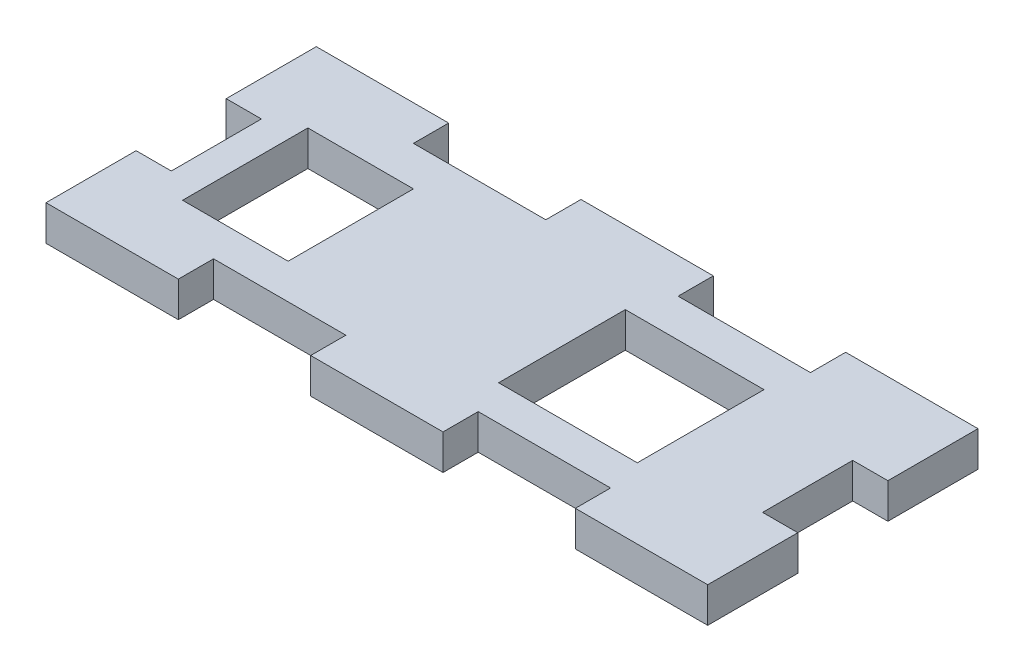
ISO-10303-21;
HEADER;
FILE_DESCRIPTION(('STEP AP214'),'2;1');
FILE_NAME('part.step','',(''),(''),'','','');
FILE_SCHEMA(('AUTOMOTIVE_DESIGN { 1 0 10303 214 1 1 1 1 }'));
ENDSEC;
DATA;
#1=APPLICATION_CONTEXT('core data for automotive mechanical design processes');
#2=APPLICATION_PROTOCOL_DEFINITION('international standard','automotive_design',2000,#1);
#3=PRODUCT_CONTEXT('',#1,'mechanical');
#4=PRODUCT('Part','Part','',(#3));
#5=PRODUCT_RELATED_PRODUCT_CATEGORY('part','',(#4));
#6=PRODUCT_DEFINITION_FORMATION('','',#4);
#7=PRODUCT_DEFINITION_CONTEXT('part definition',#1,'design');
#8=PRODUCT_DEFINITION('design','',#6,#7);
#9=PRODUCT_DEFINITION_SHAPE('','',#8);
#10=(LENGTH_UNIT() NAMED_UNIT(*) SI_UNIT(.MILLI.,.METRE.));
#11=(NAMED_UNIT(*) PLANE_ANGLE_UNIT() SI_UNIT($,.RADIAN.));
#12=(NAMED_UNIT(*) SI_UNIT($,.STERADIAN.) SOLID_ANGLE_UNIT());
#13=UNCERTAINTY_MEASURE_WITH_UNIT(LENGTH_MEASURE(1.E-05),#10,'distance_accuracy_value','');
#14=(GEOMETRIC_REPRESENTATION_CONTEXT(3) GLOBAL_UNCERTAINTY_ASSIGNED_CONTEXT((#13)) GLOBAL_UNIT_ASSIGNED_CONTEXT((#10,
#11,#12)) REPRESENTATION_CONTEXT('',''));
#15=CARTESIAN_POINT('',(0.,0.,0.));
#16=DIRECTION('',(0.,0.,1.));
#17=DIRECTION('',(1.,0.,0.));
#18=AXIS2_PLACEMENT_3D('',#15,#16,#17);
#19=CARTESIAN_POINT('',(29.845,3.175,12.192));
#20=DIRECTION('',(-1.,0.,0.));
#21=DIRECTION('',(0.,0.,1.));
#22=AXIS2_PLACEMENT_3D('',#19,#20,#21);
#23=PLANE('',#22);
#24=DIRECTION('',(0.,0.,-1.));
#25=VECTOR('',#24,1.);
#26=CARTESIAN_POINT('',(29.845,0.,12.192));
#27=LINE('',#26,#25);
#28=CARTESIAN_POINT('',(29.845,0.,12.192));
#29=VERTEX_POINT('',#28);
#30=CARTESIAN_POINT('',(29.845,0.,4.064));
#31=VERTEX_POINT('',#30);
#32=EDGE_CURVE('E506',#29,#31,#27,.T.);
#33=ORIENTED_EDGE('',*,*,#32,.T.);
#34=DIRECTION('',(0.,1.,0.));
#35=VECTOR('',#34,1.);
#36=CARTESIAN_POINT('',(29.845,3.175,4.064));
#37=LINE('',#36,#35);
#38=CARTESIAN_POINT('',(29.845,3.175,4.064));
#39=VERTEX_POINT('',#38);
#40=EDGE_CURVE('E372',#31,#39,#37,.T.);
#41=ORIENTED_EDGE('',*,*,#40,.T.);
#42=DIRECTION('',(0.,0.,-1.));
#43=VECTOR('',#42,1.);
#44=CARTESIAN_POINT('',(29.845,3.175,12.192));
#45=LINE('',#44,#43);
#46=CARTESIAN_POINT('',(29.845,3.175,12.192));
#47=VERTEX_POINT('',#46);
#48=EDGE_CURVE('E487',#47,#39,#45,.T.);
#49=ORIENTED_EDGE('',*,*,#48,.F.);
#50=DIRECTION('',(0.,-1.,0.));
#51=VECTOR('',#50,1.);
#52=CARTESIAN_POINT('',(29.845,3.175,12.192));
#53=LINE('',#52,#51);
#54=EDGE_CURVE('E504',#47,#29,#53,.T.);
#55=ORIENTED_EDGE('',*,*,#54,.T.);
#56=EDGE_LOOP('',(#33,#41,#49,#55));
#57=FACE_BOUND('',#56,.T.);
#58=ADVANCED_FACE('F32',(#57),#23,.F.);
#59=CARTESIAN_POINT('',(-29.845,3.175,12.192));
#60=DIRECTION('',(1.,0.,0.));
#61=DIRECTION('',(0.,0.,-1.));
#62=AXIS2_PLACEMENT_3D('',#59,#60,#61);
#63=PLANE('',#62);
#64=DIRECTION('',(0.,0.,1.));
#65=VECTOR('',#64,1.);
#66=CARTESIAN_POINT('',(-29.845,3.175,12.192));
#67=LINE('',#66,#65);
#68=CARTESIAN_POINT('',(-29.845,3.175,4.064));
#69=VERTEX_POINT('',#68);
#70=CARTESIAN_POINT('',(-29.845,3.175,12.192));
#71=VERTEX_POINT('',#70);
#72=EDGE_CURVE('E495',#69,#71,#67,.T.);
#73=ORIENTED_EDGE('',*,*,#72,.F.);
#74=DIRECTION('',(0.,-1.,0.));
#75=VECTOR('',#74,1.);
#76=CARTESIAN_POINT('',(-29.845,3.175,4.064));
#77=LINE('',#76,#75);
#78=CARTESIAN_POINT('',(-29.845,0.,4.064));
#79=VERTEX_POINT('',#78);
#80=EDGE_CURVE('E378',#69,#79,#77,.T.);
#81=ORIENTED_EDGE('',*,*,#80,.T.);
#82=DIRECTION('',(0.,0.,1.));
#83=VECTOR('',#82,1.);
#84=CARTESIAN_POINT('',(-29.845,0.,12.192));
#85=LINE('',#84,#83);
#86=CARTESIAN_POINT('',(-29.845,0.,12.192));
#87=VERTEX_POINT('',#86);
#88=EDGE_CURVE('E513',#79,#87,#85,.T.);
#89=ORIENTED_EDGE('',*,*,#88,.T.);
#90=DIRECTION('',(0.,-1.,0.));
#91=VECTOR('',#90,1.);
#92=CARTESIAN_POINT('',(-29.845,3.175,12.192));
#93=LINE('',#92,#91);
#94=EDGE_CURVE('E525',#71,#87,#93,.T.);
#95=ORIENTED_EDGE('',*,*,#94,.F.);
#96=EDGE_LOOP('',(#73,#81,#89,#95));
#97=FACE_BOUND('',#96,.T.);
#98=ADVANCED_FACE('F602',(#97),#63,.F.);
#99=CARTESIAN_POINT('',(-29.845,3.175,-12.192));
#100=DIRECTION('',(0.,0.,1.));
#101=DIRECTION('',(1.,0.,0.));
#102=AXIS2_PLACEMENT_3D('',#99,#100,#101);
#103=PLANE('',#102);
#104=DIRECTION('',(-1.,0.,0.));
#105=VECTOR('',#104,1.);
#106=CARTESIAN_POINT('',(-29.845,3.175,-12.192));
#107=LINE('',#106,#105);
#108=CARTESIAN_POINT('',(-17.907,3.175,-12.192));
#109=VERTEX_POINT('',#108);
#110=CARTESIAN_POINT('',(-29.845,3.175,-12.192));
#111=VERTEX_POINT('',#110);
#112=EDGE_CURVE('E490',#109,#111,#107,.T.);
#113=ORIENTED_EDGE('',*,*,#112,.F.);
#114=DIRECTION('',(0.,1.,0.));
#115=VECTOR('',#114,1.);
#116=CARTESIAN_POINT('',(-17.907,0.,-12.192));
#117=LINE('',#116,#115);
#118=CARTESIAN_POINT('',(-17.907,0.,-12.192));
#119=VERTEX_POINT('',#118);
#120=EDGE_CURVE('E401',#119,#109,#117,.T.);
#121=ORIENTED_EDGE('',*,*,#120,.F.);
#122=DIRECTION('',(-1.,0.,0.));
#123=VECTOR('',#122,1.);
#124=CARTESIAN_POINT('',(-29.845,0.,-12.192));
#125=LINE('',#124,#123);
#126=CARTESIAN_POINT('',(-29.845,0.,-12.192));
#127=VERTEX_POINT('',#126);
#128=EDGE_CURVE('E509',#119,#127,#125,.T.);
#129=ORIENTED_EDGE('',*,*,#128,.T.);
#130=DIRECTION('',(0.,-1.,0.));
#131=VECTOR('',#130,1.);
#132=CARTESIAN_POINT('',(-29.845,3.175,-12.192));
#133=LINE('',#132,#131);
#134=EDGE_CURVE('E528',#111,#127,#133,.T.);
#135=ORIENTED_EDGE('',*,*,#134,.F.);
#136=EDGE_LOOP('',(#113,#121,#129,#135));
#137=FACE_BOUND('',#136,.T.);
#138=ADVANCED_FACE('F606',(#137),#103,.F.);
#139=CARTESIAN_POINT('',(-29.845,3.175,12.192));
#140=DIRECTION('',(0.,0.,-1.));
#141=DIRECTION('',(-1.,0.,0.));
#142=AXIS2_PLACEMENT_3D('',#139,#140,#141);
#143=PLANE('',#142);
#144=DIRECTION('',(1.,0.,0.));
#145=VECTOR('',#144,1.);
#146=CARTESIAN_POINT('',(-29.845,0.,12.192));
#147=LINE('',#146,#145);
#148=CARTESIAN_POINT('',(-17.907,0.,12.192));
#149=VERTEX_POINT('',#148);
#150=EDGE_CURVE('E519',#87,#149,#147,.T.);
#151=ORIENTED_EDGE('',*,*,#150,.T.);
#152=DIRECTION('',(0.,1.,0.));
#153=VECTOR('',#152,1.);
#154=CARTESIAN_POINT('',(-17.907,0.,12.192));
#155=LINE('',#154,#153);
#156=CARTESIAN_POINT('',(-17.907,3.175,12.192));
#157=VERTEX_POINT('',#156);
#158=EDGE_CURVE('E420',#149,#157,#155,.T.);
#159=ORIENTED_EDGE('',*,*,#158,.T.);
#160=DIRECTION('',(1.,0.,0.));
#161=VECTOR('',#160,1.);
#162=CARTESIAN_POINT('',(-29.845,3.175,12.192));
#163=LINE('',#162,#161);
#164=EDGE_CURVE('E501',#71,#157,#163,.T.);
#165=ORIENTED_EDGE('',*,*,#164,.F.);
#166=ORIENTED_EDGE('',*,*,#94,.T.);
#167=EDGE_LOOP('',(#151,#159,#165,#166));
#168=FACE_BOUND('',#167,.T.);
#169=ADVANCED_FACE('F617',(#168),#143,.F.);
#170=CARTESIAN_POINT('',(5.969,0.,-12.192));
#171=VERTEX_POINT('',#170);
#172=CARTESIAN_POINT('',(-5.969,0.,-12.192));
#173=VERTEX_POINT('',#172);
#174=EDGE_CURVE('E514',#171,#173,#125,.T.);
#175=ORIENTED_EDGE('',*,*,#174,.T.);
#176=DIRECTION('',(0.,1.,0.));
#177=VECTOR('',#176,1.);
#178=CARTESIAN_POINT('',(-5.969,0.,-12.192));
#179=LINE('',#178,#177);
#180=CARTESIAN_POINT('',(-5.969,3.175,-12.192));
#181=VERTEX_POINT('',#180);
#182=EDGE_CURVE('E404',#173,#181,#179,.T.);
#183=ORIENTED_EDGE('',*,*,#182,.T.);
#184=CARTESIAN_POINT('',(5.969,3.175,-12.192));
#185=VERTEX_POINT('',#184);
#186=EDGE_CURVE('E496',#185,#181,#107,.T.);
#187=ORIENTED_EDGE('',*,*,#186,.F.);
#188=DIRECTION('',(0.,1.,0.));
#189=VECTOR('',#188,1.);
#190=CARTESIAN_POINT('',(5.969,0.,-12.192));
#191=LINE('',#190,#189);
#192=EDGE_CURVE('E453',#171,#185,#191,.T.);
#193=ORIENTED_EDGE('',*,*,#192,.F.);
#194=EDGE_LOOP('',(#175,#183,#187,#193));
#195=FACE_BOUND('',#194,.T.);
#196=ADVANCED_FACE('F615',(#195),#103,.F.);
#197=CARTESIAN_POINT('',(-5.969,3.175,12.192));
#198=VERTEX_POINT('',#197);
#199=CARTESIAN_POINT('',(5.96899999999999,3.175,12.192));
#200=VERTEX_POINT('',#199);
#201=EDGE_CURVE('E505',#198,#200,#163,.T.);
#202=ORIENTED_EDGE('',*,*,#201,.F.);
#203=DIRECTION('',(0.,1.,0.));
#204=VECTOR('',#203,1.);
#205=CARTESIAN_POINT('',(-5.969,0.,12.192));
#206=LINE('',#205,#204);
#207=CARTESIAN_POINT('',(-5.969,0.,12.192));
#208=VERTEX_POINT('',#207);
#209=EDGE_CURVE('E430',#208,#198,#206,.T.);
#210=ORIENTED_EDGE('',*,*,#209,.F.);
#211=CARTESIAN_POINT('',(5.96899999999999,0.,12.192));
#212=VERTEX_POINT('',#211);
#213=EDGE_CURVE('E522',#208,#212,#147,.T.);
#214=ORIENTED_EDGE('',*,*,#213,.T.);
#215=DIRECTION('',(0.,1.,0.));
#216=VECTOR('',#215,1.);
#217=CARTESIAN_POINT('',(5.96899999999999,0.,12.192));
#218=LINE('',#217,#216);
#219=EDGE_CURVE('E472',#212,#200,#218,.T.);
#220=ORIENTED_EDGE('',*,*,#219,.T.);
#221=EDGE_LOOP('',(#202,#210,#214,#220));
#222=FACE_BOUND('',#221,.T.);
#223=ADVANCED_FACE('F573',(#222),#143,.F.);
#224=CARTESIAN_POINT('',(29.845,3.175,-4.064));
#225=VERTEX_POINT('',#224);
#226=CARTESIAN_POINT('',(29.845,3.175,-12.192));
#227=VERTEX_POINT('',#226);
#228=EDGE_CURVE('E491',#225,#227,#45,.T.);
#229=ORIENTED_EDGE('',*,*,#228,.F.);
#230=DIRECTION('',(0.,-1.,0.));
#231=VECTOR('',#230,1.);
#232=CARTESIAN_POINT('',(29.845,3.175,-4.064));
#233=LINE('',#232,#231);
#234=CARTESIAN_POINT('',(29.845,0.,-4.064));
#235=VERTEX_POINT('',#234);
#236=EDGE_CURVE('E352',#225,#235,#233,.T.);
#237=ORIENTED_EDGE('',*,*,#236,.T.);
#238=CARTESIAN_POINT('',(29.845,0.,-12.192));
#239=VERTEX_POINT('',#238);
#240=EDGE_CURVE('E455',#235,#239,#27,.T.);
#241=ORIENTED_EDGE('',*,*,#240,.T.);
#242=DIRECTION('',(0.,-1.,0.));
#243=VECTOR('',#242,1.);
#244=CARTESIAN_POINT('',(29.845,3.175,-12.192));
#245=LINE('',#244,#243);
#246=EDGE_CURVE('E531',#227,#239,#245,.T.);
#247=ORIENTED_EDGE('',*,*,#246,.F.);
#248=EDGE_LOOP('',(#229,#237,#241,#247));
#249=FACE_BOUND('',#248,.T.);
#250=ADVANCED_FACE('F34',(#249),#23,.F.);
#251=CARTESIAN_POINT('',(17.907,0.,-12.192));
#252=VERTEX_POINT('',#251);
#253=EDGE_CURVE('E510',#239,#252,#125,.T.);
#254=ORIENTED_EDGE('',*,*,#253,.T.);
#255=DIRECTION('',(0.,1.,0.));
#256=VECTOR('',#255,1.);
#257=CARTESIAN_POINT('',(17.907,0.,-12.192));
#258=LINE('',#257,#256);
#259=CARTESIAN_POINT('',(17.907,3.175,-12.192));
#260=VERTEX_POINT('',#259);
#261=EDGE_CURVE('E456',#252,#260,#258,.T.);
#262=ORIENTED_EDGE('',*,*,#261,.T.);
#263=EDGE_CURVE('E492',#227,#260,#107,.T.);
#264=ORIENTED_EDGE('',*,*,#263,.F.);
#265=ORIENTED_EDGE('',*,*,#246,.T.);
#266=EDGE_LOOP('',(#254,#262,#264,#265));
#267=FACE_BOUND('',#266,.T.);
#268=ADVANCED_FACE('F547',(#267),#103,.F.);
#269=CARTESIAN_POINT('',(-29.845,0.,-4.06399999999999));
#270=VERTEX_POINT('',#269);
#271=EDGE_CURVE('E515',#127,#270,#85,.T.);
#272=ORIENTED_EDGE('',*,*,#271,.T.);
#273=DIRECTION('',(0.,1.,0.));
#274=VECTOR('',#273,1.);
#275=CARTESIAN_POINT('',(-29.845,3.175,-4.064));
#276=LINE('',#275,#274);
#277=CARTESIAN_POINT('',(-29.845,3.175,-4.064));
#278=VERTEX_POINT('',#277);
#279=EDGE_CURVE('E375',#270,#278,#276,.T.);
#280=ORIENTED_EDGE('',*,*,#279,.T.);
#281=EDGE_CURVE('E497',#111,#278,#67,.T.);
#282=ORIENTED_EDGE('',*,*,#281,.F.);
#283=ORIENTED_EDGE('',*,*,#134,.T.);
#284=EDGE_LOOP('',(#272,#280,#282,#283));
#285=FACE_BOUND('',#284,.T.);
#286=ADVANCED_FACE('F609',(#285),#63,.F.);
#287=CARTESIAN_POINT('',(17.907,3.175,12.192));
#288=VERTEX_POINT('',#287);
#289=EDGE_CURVE('E500',#288,#47,#163,.T.);
#290=ORIENTED_EDGE('',*,*,#289,.F.);
#291=DIRECTION('',(0.,1.,0.));
#292=VECTOR('',#291,1.);
#293=CARTESIAN_POINT('',(17.907,0.,12.192));
#294=LINE('',#293,#292);
#295=CARTESIAN_POINT('',(17.907,0.,12.192));
#296=VERTEX_POINT('',#295);
#297=EDGE_CURVE('E483',#296,#288,#294,.T.);
#298=ORIENTED_EDGE('',*,*,#297,.F.);
#299=EDGE_CURVE('E518',#296,#29,#147,.T.);
#300=ORIENTED_EDGE('',*,*,#299,.T.);
#301=ORIENTED_EDGE('',*,*,#54,.F.);
#302=EDGE_LOOP('',(#290,#298,#300,#301));
#303=FACE_BOUND('',#302,.T.);
#304=ADVANCED_FACE('F566',(#303),#143,.F.);
#305=CARTESIAN_POINT('',(0.,3.175,0.));
#306=DIRECTION('',(0.,-1.,0.));
#307=DIRECTION('',(0.,0.,-1.));
#308=AXIS2_PLACEMENT_3D('',#305,#306,#307);
#309=PLANE('',#308);
#310=DIRECTION('',(1.,0.,0.));
#311=VECTOR('',#310,1.);
#312=CARTESIAN_POINT('',(-23.876,3.175,5.842));
#313=LINE('',#312,#311);
#314=CARTESIAN_POINT('',(-23.876,3.175,5.842));
#315=VERTEX_POINT('',#314);
#316=CARTESIAN_POINT('',(-14.351,3.175,5.842));
#317=VERTEX_POINT('',#316);
#318=EDGE_CURVE('E294',#315,#317,#313,.T.);
#319=ORIENTED_EDGE('',*,*,#318,.F.);
#320=DIRECTION('',(0.,0.,1.));
#321=VECTOR('',#320,1.);
#322=CARTESIAN_POINT('',(-23.876,3.175,5.842));
#323=LINE('',#322,#321);
#324=CARTESIAN_POINT('',(-23.876,3.175,-5.461));
#325=VERTEX_POINT('',#324);
#326=EDGE_CURVE('E47',#325,#315,#323,.T.);
#327=ORIENTED_EDGE('',*,*,#326,.F.);
#328=DIRECTION('',(-1.,0.,0.));
#329=VECTOR('',#328,1.);
#330=CARTESIAN_POINT('',(-23.876,3.175,-5.461));
#331=LINE('',#330,#329);
#332=CARTESIAN_POINT('',(-14.351,3.175,-5.461));
#333=VERTEX_POINT('',#332);
#334=EDGE_CURVE('E285',#333,#325,#331,.T.);
#335=ORIENTED_EDGE('',*,*,#334,.F.);
#336=DIRECTION('',(0.,0.,-1.));
#337=VECTOR('',#336,1.);
#338=CARTESIAN_POINT('',(-14.351,3.175,5.842));
#339=LINE('',#338,#337);
#340=EDGE_CURVE('E288',#317,#333,#339,.T.);
#341=ORIENTED_EDGE('',*,*,#340,.F.);
#342=EDGE_LOOP('',(#319,#327,#335,#341));
#343=FACE_BOUND('',#342,.T.);
#344=DIRECTION('',(1.,0.,0.));
#345=VECTOR('',#344,1.);
#346=CARTESIAN_POINT('',(17.145,3.175,5.842));
#347=LINE('',#346,#345);
#348=CARTESIAN_POINT('',(4.6355,3.175,5.842));
#349=VERTEX_POINT('',#348);
#350=CARTESIAN_POINT('',(17.145,3.175,5.842));
#351=VERTEX_POINT('',#350);
#352=EDGE_CURVE('E320',#349,#351,#347,.T.);
#353=ORIENTED_EDGE('',*,*,#352,.F.);
#354=DIRECTION('',(0.,0.,1.));
#355=VECTOR('',#354,1.);
#356=CARTESIAN_POINT('',(4.6355,3.175,5.842));
#357=LINE('',#356,#355);
#358=CARTESIAN_POINT('',(4.6355,3.175,-5.588));
#359=VERTEX_POINT('',#358);
#360=EDGE_CURVE('E55',#359,#349,#357,.T.);
#361=ORIENTED_EDGE('',*,*,#360,.F.);
#362=DIRECTION('',(-1.,0.,0.));
#363=VECTOR('',#362,1.);
#364=CARTESIAN_POINT('',(17.145,3.175,-5.588));
#365=LINE('',#364,#363);
#366=CARTESIAN_POINT('',(17.145,3.175,-5.588));
#367=VERTEX_POINT('',#366);
#368=EDGE_CURVE('E309',#367,#359,#365,.T.);
#369=ORIENTED_EDGE('',*,*,#368,.F.);
#370=DIRECTION('',(0.,0.,-1.));
#371=VECTOR('',#370,1.);
#372=CARTESIAN_POINT('',(17.145,3.175,5.842));
#373=LINE('',#372,#371);
#374=EDGE_CURVE('E323',#351,#367,#373,.T.);
#375=ORIENTED_EDGE('',*,*,#374,.F.);
#376=EDGE_LOOP('',(#353,#361,#369,#375));
#377=FACE_BOUND('',#376,.T.);
#378=DIRECTION('',(0.,0.,-1.));
#379=VECTOR('',#378,1.);
#380=CARTESIAN_POINT('',(-26.67,3.175,4.064));
#381=LINE('',#380,#379);
#382=CARTESIAN_POINT('',(-26.67,3.175,4.064));
#383=VERTEX_POINT('',#382);
#384=CARTESIAN_POINT('',(-26.67,3.175,-4.064));
#385=VERTEX_POINT('',#384);
#386=EDGE_CURVE('E342',#383,#385,#381,.T.);
#387=ORIENTED_EDGE('',*,*,#386,.F.);
#388=DIRECTION('',(1.,0.,0.));
#389=VECTOR('',#388,1.);
#390=CARTESIAN_POINT('',(-33.02,3.175,4.064));
#391=LINE('',#390,#389);
#392=EDGE_CURVE('E338',#69,#383,#391,.T.);
#393=ORIENTED_EDGE('',*,*,#392,.F.);
#394=ORIENTED_EDGE('',*,*,#72,.T.);
#395=ORIENTED_EDGE('',*,*,#164,.T.);
#396=DIRECTION('',(0.,0.,1.));
#397=VECTOR('',#396,1.);
#398=CARTESIAN_POINT('',(-17.907,3.175,12.192));
#399=LINE('',#398,#397);
#400=CARTESIAN_POINT('',(-17.907,3.175,9.017));
#401=VERTEX_POINT('',#400);
#402=EDGE_CURVE('E381',#401,#157,#399,.T.);
#403=ORIENTED_EDGE('',*,*,#402,.F.);
#404=DIRECTION('',(-1.,0.,0.));
#405=VECTOR('',#404,1.);
#406=CARTESIAN_POINT('',(-17.907,3.175,9.017));
#407=LINE('',#406,#405);
#408=CARTESIAN_POINT('',(-5.969,3.175,9.017));
#409=VERTEX_POINT('',#408);
#410=EDGE_CURVE('E414',#409,#401,#407,.T.);
#411=ORIENTED_EDGE('',*,*,#410,.F.);
#412=DIRECTION('',(0.,0.,-1.));
#413=VECTOR('',#412,1.);
#414=CARTESIAN_POINT('',(-5.969,3.175,12.192));
#415=LINE('',#414,#413);
#416=EDGE_CURVE('E422',#198,#409,#415,.T.);
#417=ORIENTED_EDGE('',*,*,#416,.F.);
#418=ORIENTED_EDGE('',*,*,#201,.T.);
#419=DIRECTION('',(0.,0.,1.));
#420=VECTOR('',#419,1.);
#421=CARTESIAN_POINT('',(5.96899999999999,3.175,12.192));
#422=LINE('',#421,#420);
#423=CARTESIAN_POINT('',(5.96899999999999,3.175,9.017));
#424=VERTEX_POINT('',#423);
#425=EDGE_CURVE('E403',#424,#200,#422,.T.);
#426=ORIENTED_EDGE('',*,*,#425,.F.);
#427=DIRECTION('',(-1.,0.,0.));
#428=VECTOR('',#427,1.);
#429=CARTESIAN_POINT('',(5.96899999999999,3.175,9.017));
#430=LINE('',#429,#428);
#431=CARTESIAN_POINT('',(17.907,3.175,9.017));
#432=VERTEX_POINT('',#431);
#433=EDGE_CURVE('E466',#432,#424,#430,.T.);
#434=ORIENTED_EDGE('',*,*,#433,.F.);
#435=DIRECTION('',(0.,0.,-1.));
#436=VECTOR('',#435,1.);
#437=CARTESIAN_POINT('',(17.907,3.175,12.192));
#438=LINE('',#437,#436);
#439=EDGE_CURVE('E475',#288,#432,#438,.T.);
#440=ORIENTED_EDGE('',*,*,#439,.F.);
#441=ORIENTED_EDGE('',*,*,#289,.T.);
#442=ORIENTED_EDGE('',*,*,#48,.T.);
#443=DIRECTION('',(1.,0.,0.));
#444=VECTOR('',#443,1.);
#445=CARTESIAN_POINT('',(26.67,3.175,4.064));
#446=LINE('',#445,#444);
#447=CARTESIAN_POINT('',(26.67,3.175,4.064));
#448=VERTEX_POINT('',#447);
#449=EDGE_CURVE('E358',#448,#39,#446,.T.);
#450=ORIENTED_EDGE('',*,*,#449,.F.);
#451=DIRECTION('',(0.,0.,1.));
#452=VECTOR('',#451,1.);
#453=CARTESIAN_POINT('',(26.67,3.175,4.064));
#454=LINE('',#453,#452);
#455=CARTESIAN_POINT('',(26.67,3.175,-4.064));
#456=VERTEX_POINT('',#455);
#457=EDGE_CURVE('E363',#456,#448,#454,.T.);
#458=ORIENTED_EDGE('',*,*,#457,.F.);
#459=DIRECTION('',(-1.,0.,0.));
#460=VECTOR('',#459,1.);
#461=CARTESIAN_POINT('',(26.67,3.175,-4.064));
#462=LINE('',#461,#460);
#463=EDGE_CURVE('E301',#225,#456,#462,.T.);
#464=ORIENTED_EDGE('',*,*,#463,.F.);
#465=ORIENTED_EDGE('',*,*,#228,.T.);
#466=ORIENTED_EDGE('',*,*,#263,.T.);
#467=DIRECTION('',(0.,0.,-1.));
#468=VECTOR('',#467,1.);
#469=CARTESIAN_POINT('',(17.907,3.175,-9.01700000000001));
#470=LINE('',#469,#468);
#471=CARTESIAN_POINT('',(17.907,3.175,-9.01700000000001));
#472=VERTEX_POINT('',#471);
#473=EDGE_CURVE('E438',#472,#260,#470,.T.);
#474=ORIENTED_EDGE('',*,*,#473,.F.);
#475=DIRECTION('',(1.,0.,0.));
#476=VECTOR('',#475,1.);
#477=CARTESIAN_POINT('',(5.969,3.175,-9.01700000000001));
#478=LINE('',#477,#476);
#479=CARTESIAN_POINT('',(5.969,3.175,-9.01700000000001));
#480=VERTEX_POINT('',#479);
#481=EDGE_CURVE('E448',#480,#472,#478,.T.);
#482=ORIENTED_EDGE('',*,*,#481,.F.);
#483=DIRECTION('',(0.,0.,1.));
#484=VECTOR('',#483,1.);
#485=CARTESIAN_POINT('',(5.969,3.175,-9.01700000000001));
#486=LINE('',#485,#484);
#487=EDGE_CURVE('E445',#185,#480,#486,.T.);
#488=ORIENTED_EDGE('',*,*,#487,.F.);
#489=ORIENTED_EDGE('',*,*,#186,.T.);
#490=DIRECTION('',(0.,0.,-1.));
#491=VECTOR('',#490,1.);
#492=CARTESIAN_POINT('',(-5.969,3.175,-9.01700000000001));
#493=LINE('',#492,#491);
#494=CARTESIAN_POINT('',(-5.969,3.175,-9.01700000000001));
#495=VERTEX_POINT('',#494);
#496=EDGE_CURVE('E386',#495,#181,#493,.T.);
#497=ORIENTED_EDGE('',*,*,#496,.F.);
#498=DIRECTION('',(1.,0.,0.));
#499=VECTOR('',#498,1.);
#500=CARTESIAN_POINT('',(-17.907,3.175,-9.01700000000001));
#501=LINE('',#500,#499);
#502=CARTESIAN_POINT('',(-17.907,3.175,-9.01700000000001));
#503=VERTEX_POINT('',#502);
#504=EDGE_CURVE('E396',#503,#495,#501,.T.);
#505=ORIENTED_EDGE('',*,*,#504,.F.);
#506=DIRECTION('',(0.,0.,1.));
#507=VECTOR('',#506,1.);
#508=CARTESIAN_POINT('',(-17.907,3.175,-9.01700000000001));
#509=LINE('',#508,#507);
#510=EDGE_CURVE('E393',#109,#503,#509,.T.);
#511=ORIENTED_EDGE('',*,*,#510,.F.);
#512=ORIENTED_EDGE('',*,*,#112,.T.);
#513=ORIENTED_EDGE('',*,*,#281,.T.);
#514=DIRECTION('',(-1.,0.,0.));
#515=VECTOR('',#514,1.);
#516=CARTESIAN_POINT('',(-33.02,3.175,-4.064));
#517=LINE('',#516,#515);
#518=EDGE_CURVE('E345',#385,#278,#517,.T.);
#519=ORIENTED_EDGE('',*,*,#518,.F.);
#520=EDGE_LOOP('',(#387,#393,#394,#395,#403,#411,#417,#418,#426,#434,#440,#441,#442,#450,#458,
#464,#465,#466,#474,#482,#488,#489,#497,#505,#511,#512,#513,#519));
#521=FACE_BOUND('',#520,.T.);
#522=ADVANCED_FACE('F551',(#343,#377,#521),#309,.F.);
#523=CARTESIAN_POINT('',(0.,0.,0.));
#524=DIRECTION('',(0.,-1.,0.));
#525=DIRECTION('',(0.,0.,-1.));
#526=AXIS2_PLACEMENT_3D('',#523,#524,#525);
#527=PLANE('',#526);
#528=DIRECTION('',(0.,0.,1.));
#529=VECTOR('',#528,1.);
#530=CARTESIAN_POINT('',(-23.876,0.,5.842));
#531=LINE('',#530,#529);
#532=CARTESIAN_POINT('',(-23.876,0.,-5.461));
#533=VERTEX_POINT('',#532);
#534=CARTESIAN_POINT('',(-23.876,0.,5.842));
#535=VERTEX_POINT('',#534);
#536=EDGE_CURVE('E266',#533,#535,#531,.T.);
#537=ORIENTED_EDGE('',*,*,#536,.T.);
#538=DIRECTION('',(1.,0.,0.));
#539=VECTOR('',#538,1.);
#540=CARTESIAN_POINT('',(-23.876,0.,5.842));
#541=LINE('',#540,#539);
#542=CARTESIAN_POINT('',(-14.351,0.,5.842));
#543=VERTEX_POINT('',#542);
#544=EDGE_CURVE('E276',#535,#543,#541,.T.);
#545=ORIENTED_EDGE('',*,*,#544,.T.);
#546=DIRECTION('',(0.,0.,-1.));
#547=VECTOR('',#546,1.);
#548=CARTESIAN_POINT('',(-14.351,0.,5.842));
#549=LINE('',#548,#547);
#550=CARTESIAN_POINT('',(-14.351,0.,-5.461));
#551=VERTEX_POINT('',#550);
#552=EDGE_CURVE('E280',#543,#551,#549,.T.);
#553=ORIENTED_EDGE('',*,*,#552,.T.);
#554=DIRECTION('',(-1.,0.,0.));
#555=VECTOR('',#554,1.);
#556=CARTESIAN_POINT('',(-23.876,0.,-5.461));
#557=LINE('',#556,#555);
#558=EDGE_CURVE('E272',#551,#533,#557,.T.);
#559=ORIENTED_EDGE('',*,*,#558,.T.);
#560=EDGE_LOOP('',(#537,#545,#553,#559));
#561=FACE_BOUND('',#560,.T.);
#562=DIRECTION('',(0.,0.,1.));
#563=VECTOR('',#562,1.);
#564=CARTESIAN_POINT('',(4.6355,0.,5.842));
#565=LINE('',#564,#563);
#566=CARTESIAN_POINT('',(4.6355,0.,-5.588));
#567=VERTEX_POINT('',#566);
#568=CARTESIAN_POINT('',(4.6355,0.,5.842));
#569=VERTEX_POINT('',#568);
#570=EDGE_CURVE('E305',#567,#569,#565,.T.);
#571=ORIENTED_EDGE('',*,*,#570,.T.);
#572=DIRECTION('',(1.,0.,0.));
#573=VECTOR('',#572,1.);
#574=CARTESIAN_POINT('',(17.145,0.,5.842));
#575=LINE('',#574,#573);
#576=CARTESIAN_POINT('',(17.145,0.,5.842));
#577=VERTEX_POINT('',#576);
#578=EDGE_CURVE('E308',#569,#577,#575,.T.);
#579=ORIENTED_EDGE('',*,*,#578,.T.);
#580=DIRECTION('',(0.,0.,-1.));
#581=VECTOR('',#580,1.);
#582=CARTESIAN_POINT('',(17.145,0.,5.842));
#583=LINE('',#582,#581);
#584=CARTESIAN_POINT('',(17.145,0.,-5.588));
#585=VERTEX_POINT('',#584);
#586=EDGE_CURVE('E312',#577,#585,#583,.T.);
#587=ORIENTED_EDGE('',*,*,#586,.T.);
#588=DIRECTION('',(-1.,0.,0.));
#589=VECTOR('',#588,1.);
#590=CARTESIAN_POINT('',(17.145,0.,-5.588));
#591=LINE('',#590,#589);
#592=EDGE_CURVE('E315',#585,#567,#591,.T.);
#593=ORIENTED_EDGE('',*,*,#592,.T.);
#594=EDGE_LOOP('',(#571,#579,#587,#593));
#595=FACE_BOUND('',#594,.T.);
#596=DIRECTION('',(-1.,0.,0.));
#597=VECTOR('',#596,1.);
#598=CARTESIAN_POINT('',(0.,0.,4.064));
#599=LINE('',#598,#597);
#600=CARTESIAN_POINT('',(-26.67,0.,4.064));
#601=VERTEX_POINT('',#600);
#602=EDGE_CURVE('E11',#601,#79,#599,.T.);
#603=ORIENTED_EDGE('',*,*,#602,.F.);
#604=DIRECTION('',(0.,0.,-1.));
#605=VECTOR('',#604,1.);
#606=CARTESIAN_POINT('',(-26.67,0.,4.064));
#607=LINE('',#606,#605);
#608=CARTESIAN_POINT('',(-26.67,0.,-4.064));
#609=VERTEX_POINT('',#608);
#610=EDGE_CURVE('E334',#601,#609,#607,.T.);
#611=ORIENTED_EDGE('',*,*,#610,.T.);
#612=DIRECTION('',(-1.,0.,0.));
#613=VECTOR('',#612,1.);
#614=CARTESIAN_POINT('',(-33.02,0.,-4.064));
#615=LINE('',#614,#613);
#616=EDGE_CURVE('E337',#609,#270,#615,.T.);
#617=ORIENTED_EDGE('',*,*,#616,.T.);
#618=ORIENTED_EDGE('',*,*,#271,.F.);
#619=ORIENTED_EDGE('',*,*,#128,.F.);
#620=DIRECTION('',(0.,0.,1.));
#621=VECTOR('',#620,1.);
#622=CARTESIAN_POINT('',(-17.907,0.,-9.01700000000001));
#623=LINE('',#622,#621);
#624=CARTESIAN_POINT('',(-17.907,0.,-9.01700000000001));
#625=VERTEX_POINT('',#624);
#626=EDGE_CURVE('E382',#119,#625,#623,.T.);
#627=ORIENTED_EDGE('',*,*,#626,.T.);
#628=DIRECTION('',(1.,0.,0.));
#629=VECTOR('',#628,1.);
#630=CARTESIAN_POINT('',(-17.907,0.,-9.01700000000001));
#631=LINE('',#630,#629);
#632=CARTESIAN_POINT('',(-5.969,0.,-9.01700000000001));
#633=VERTEX_POINT('',#632);
#634=EDGE_CURVE('E385',#625,#633,#631,.T.);
#635=ORIENTED_EDGE('',*,*,#634,.T.);
#636=DIRECTION('',(0.,0.,-1.));
#637=VECTOR('',#636,1.);
#638=CARTESIAN_POINT('',(-5.969,0.,-9.01700000000001));
#639=LINE('',#638,#637);
#640=EDGE_CURVE('E389',#633,#173,#639,.T.);
#641=ORIENTED_EDGE('',*,*,#640,.T.);
#642=ORIENTED_EDGE('',*,*,#174,.F.);
#643=DIRECTION('',(0.,0.,1.));
#644=VECTOR('',#643,1.);
#645=CARTESIAN_POINT('',(5.969,0.,-9.01700000000001));
#646=LINE('',#645,#644);
#647=CARTESIAN_POINT('',(5.969,0.,-9.01700000000001));
#648=VERTEX_POINT('',#647);
#649=EDGE_CURVE('E434',#171,#648,#646,.T.);
#650=ORIENTED_EDGE('',*,*,#649,.T.);
#651=DIRECTION('',(1.,0.,0.));
#652=VECTOR('',#651,1.);
#653=CARTESIAN_POINT('',(5.969,0.,-9.01700000000001));
#654=LINE('',#653,#652);
#655=CARTESIAN_POINT('',(17.907,0.,-9.01700000000001));
#656=VERTEX_POINT('',#655);
#657=EDGE_CURVE('E437',#648,#656,#654,.T.);
#658=ORIENTED_EDGE('',*,*,#657,.T.);
#659=DIRECTION('',(0.,0.,-1.));
#660=VECTOR('',#659,1.);
#661=CARTESIAN_POINT('',(17.907,0.,-9.01700000000001));
#662=LINE('',#661,#660);
#663=EDGE_CURVE('E441',#656,#252,#662,.T.);
#664=ORIENTED_EDGE('',*,*,#663,.T.);
#665=ORIENTED_EDGE('',*,*,#253,.F.);
#666=ORIENTED_EDGE('',*,*,#240,.F.);
#667=DIRECTION('',(1.,0.,0.));
#668=VECTOR('',#667,1.);
#669=CARTESIAN_POINT('',(0.,0.,-4.064));
#670=LINE('',#669,#668);
#671=CARTESIAN_POINT('',(26.67,0.,-4.064));
#672=VERTEX_POINT('',#671);
#673=EDGE_CURVE('E40',#672,#235,#670,.T.);
#674=ORIENTED_EDGE('',*,*,#673,.F.);
#675=DIRECTION('',(0.,0.,1.));
#676=VECTOR('',#675,1.);
#677=CARTESIAN_POINT('',(26.67,0.,4.064));
#678=LINE('',#677,#676);
#679=CARTESIAN_POINT('',(26.67,0.,4.064));
#680=VERTEX_POINT('',#679);
#681=EDGE_CURVE('E354',#672,#680,#678,.T.);
#682=ORIENTED_EDGE('',*,*,#681,.T.);
#683=DIRECTION('',(1.,0.,0.));
#684=VECTOR('',#683,1.);
#685=CARTESIAN_POINT('',(26.67,0.,4.064));
#686=LINE('',#685,#684);
#687=EDGE_CURVE('E357',#680,#31,#686,.T.);
#688=ORIENTED_EDGE('',*,*,#687,.T.);
#689=ORIENTED_EDGE('',*,*,#32,.F.);
#690=ORIENTED_EDGE('',*,*,#299,.F.);
#691=DIRECTION('',(0.,0.,-1.));
#692=VECTOR('',#691,1.);
#693=CARTESIAN_POINT('',(17.907,0.,12.192));
#694=LINE('',#693,#692);
#695=CARTESIAN_POINT('',(17.907,0.,9.017));
#696=VERTEX_POINT('',#695);
#697=EDGE_CURVE('E465',#296,#696,#694,.T.);
#698=ORIENTED_EDGE('',*,*,#697,.T.);
#699=DIRECTION('',(-1.,0.,0.));
#700=VECTOR('',#699,1.);
#701=CARTESIAN_POINT('',(5.96899999999999,0.,9.017));
#702=LINE('',#701,#700);
#703=CARTESIAN_POINT('',(5.96899999999999,0.,9.017));
#704=VERTEX_POINT('',#703);
#705=EDGE_CURVE('E469',#696,#704,#702,.T.);
#706=ORIENTED_EDGE('',*,*,#705,.T.);
#707=DIRECTION('',(0.,0.,1.));
#708=VECTOR('',#707,1.);
#709=CARTESIAN_POINT('',(5.96899999999999,0.,12.192));
#710=LINE('',#709,#708);
#711=EDGE_CURVE('E462',#704,#212,#710,.T.);
#712=ORIENTED_EDGE('',*,*,#711,.T.);
#713=ORIENTED_EDGE('',*,*,#213,.F.);
#714=DIRECTION('',(0.,0.,-1.));
#715=VECTOR('',#714,1.);
#716=CARTESIAN_POINT('',(-5.969,0.,12.192));
#717=LINE('',#716,#715);
#718=CARTESIAN_POINT('',(-5.969,0.,9.017));
#719=VERTEX_POINT('',#718);
#720=EDGE_CURVE('E413',#208,#719,#717,.T.);
#721=ORIENTED_EDGE('',*,*,#720,.T.);
#722=DIRECTION('',(-1.,0.,0.));
#723=VECTOR('',#722,1.);
#724=CARTESIAN_POINT('',(-17.907,0.,9.017));
#725=LINE('',#724,#723);
#726=CARTESIAN_POINT('',(-17.907,0.,9.017));
#727=VERTEX_POINT('',#726);
#728=EDGE_CURVE('E417',#719,#727,#725,.T.);
#729=ORIENTED_EDGE('',*,*,#728,.T.);
#730=DIRECTION('',(0.,0.,1.));
#731=VECTOR('',#730,1.);
#732=CARTESIAN_POINT('',(-17.907,0.,12.192));
#733=LINE('',#732,#731);
#734=EDGE_CURVE('E410',#727,#149,#733,.T.);
#735=ORIENTED_EDGE('',*,*,#734,.T.);
#736=ORIENTED_EDGE('',*,*,#150,.F.);
#737=ORIENTED_EDGE('',*,*,#88,.F.);
#738=EDGE_LOOP('',(#603,#611,#617,#618,#619,#627,#635,#641,#642,#650,#658,#664,#665,#666,#674,
#682,#688,#689,#690,#698,#706,#712,#713,#721,#729,#735,#736,#737));
#739=FACE_BOUND('',#738,.T.);
#740=ADVANCED_FACE('F282',(#561,#595,#739),#527,.T.);
#741=CARTESIAN_POINT('',(5.96899999999999,0.,12.192));
#742=DIRECTION('',(-1.,0.,0.));
#743=DIRECTION('',(0.,0.,1.));
#744=AXIS2_PLACEMENT_3D('',#741,#742,#743);
#745=PLANE('',#744);
#746=ORIENTED_EDGE('',*,*,#425,.T.);
#747=ORIENTED_EDGE('',*,*,#219,.F.);
#748=ORIENTED_EDGE('',*,*,#711,.F.);
#749=DIRECTION('',(0.,1.,0.));
#750=VECTOR('',#749,1.);
#751=CARTESIAN_POINT('',(5.96899999999999,0.,9.017));
#752=LINE('',#751,#750);
#753=EDGE_CURVE('E449',#704,#424,#752,.T.);
#754=ORIENTED_EDGE('',*,*,#753,.T.);
#755=EDGE_LOOP('',(#746,#747,#748,#754));
#756=FACE_BOUND('',#755,.T.);
#757=ADVANCED_FACE('F576',(#756),#745,.F.);
#758=CARTESIAN_POINT('',(5.96899999999999,0.,9.017));
#759=DIRECTION('',(0.,0.,-1.));
#760=DIRECTION('',(-1.,0.,0.));
#761=AXIS2_PLACEMENT_3D('',#758,#759,#760);
#762=PLANE('',#761);
#763=ORIENTED_EDGE('',*,*,#433,.T.);
#764=ORIENTED_EDGE('',*,*,#753,.F.);
#765=ORIENTED_EDGE('',*,*,#705,.F.);
#766=DIRECTION('',(0.,1.,0.));
#767=VECTOR('',#766,1.);
#768=CARTESIAN_POINT('',(17.907,0.,9.017));
#769=LINE('',#768,#767);
#770=EDGE_CURVE('E481',#696,#432,#769,.T.);
#771=ORIENTED_EDGE('',*,*,#770,.T.);
#772=EDGE_LOOP('',(#763,#764,#765,#771));
#773=FACE_BOUND('',#772,.T.);
#774=ADVANCED_FACE('F580',(#773),#762,.F.);
#775=CARTESIAN_POINT('',(17.907,0.,12.192));
#776=DIRECTION('',(1.,0.,0.));
#777=DIRECTION('',(0.,0.,-1.));
#778=AXIS2_PLACEMENT_3D('',#775,#776,#777);
#779=PLANE('',#778);
#780=ORIENTED_EDGE('',*,*,#439,.T.);
#781=ORIENTED_EDGE('',*,*,#770,.F.);
#782=ORIENTED_EDGE('',*,*,#697,.F.);
#783=ORIENTED_EDGE('',*,*,#297,.T.);
#784=EDGE_LOOP('',(#780,#781,#782,#783));
#785=FACE_BOUND('',#784,.T.);
#786=ADVANCED_FACE('F582',(#785),#779,.F.);
#787=CARTESIAN_POINT('',(5.969,0.,-9.01700000000001));
#788=DIRECTION('',(-1.,0.,0.));
#789=DIRECTION('',(0.,0.,1.));
#790=AXIS2_PLACEMENT_3D('',#787,#788,#789);
#791=PLANE('',#790);
#792=ORIENTED_EDGE('',*,*,#487,.T.);
#793=DIRECTION('',(0.,1.,0.));
#794=VECTOR('',#793,1.);
#795=CARTESIAN_POINT('',(5.969,0.,-9.01700000000001));
#796=LINE('',#795,#794);
#797=EDGE_CURVE('E444',#648,#480,#796,.T.);
#798=ORIENTED_EDGE('',*,*,#797,.F.);
#799=ORIENTED_EDGE('',*,*,#649,.F.);
#800=ORIENTED_EDGE('',*,*,#192,.T.);
#801=EDGE_LOOP('',(#792,#798,#799,#800));
#802=FACE_BOUND('',#801,.T.);
#803=ADVANCED_FACE('F669',(#802),#791,.F.);
#804=CARTESIAN_POINT('',(17.907,0.,-9.01700000000001));
#805=DIRECTION('',(1.,0.,0.));
#806=DIRECTION('',(0.,0.,-1.));
#807=AXIS2_PLACEMENT_3D('',#804,#805,#806);
#808=PLANE('',#807);
#809=ORIENTED_EDGE('',*,*,#473,.T.);
#810=ORIENTED_EDGE('',*,*,#261,.F.);
#811=ORIENTED_EDGE('',*,*,#663,.F.);
#812=DIRECTION('',(0.,1.,0.));
#813=VECTOR('',#812,1.);
#814=CARTESIAN_POINT('',(17.907,0.,-9.01700000000001));
#815=LINE('',#814,#813);
#816=EDGE_CURVE('E459',#656,#472,#815,.T.);
#817=ORIENTED_EDGE('',*,*,#816,.T.);
#818=EDGE_LOOP('',(#809,#810,#811,#817));
#819=FACE_BOUND('',#818,.T.);
#820=ADVANCED_FACE('F675',(#819),#808,.F.);
#821=CARTESIAN_POINT('',(5.969,0.,-9.01700000000001));
#822=DIRECTION('',(0.,0.,1.));
#823=DIRECTION('',(1.,0.,0.));
#824=AXIS2_PLACEMENT_3D('',#821,#822,#823);
#825=PLANE('',#824);
#826=ORIENTED_EDGE('',*,*,#481,.T.);
#827=ORIENTED_EDGE('',*,*,#816,.F.);
#828=ORIENTED_EDGE('',*,*,#657,.F.);
#829=ORIENTED_EDGE('',*,*,#797,.T.);
#830=EDGE_LOOP('',(#826,#827,#828,#829));
#831=FACE_BOUND('',#830,.T.);
#832=ADVANCED_FACE('F673',(#831),#825,.F.);
#833=CARTESIAN_POINT('',(-17.907,0.,12.192));
#834=DIRECTION('',(-1.,0.,0.));
#835=DIRECTION('',(0.,0.,1.));
#836=AXIS2_PLACEMENT_3D('',#833,#834,#835);
#837=PLANE('',#836);
#838=ORIENTED_EDGE('',*,*,#402,.T.);
#839=ORIENTED_EDGE('',*,*,#158,.F.);
#840=ORIENTED_EDGE('',*,*,#734,.F.);
#841=DIRECTION('',(0.,1.,0.));
#842=VECTOR('',#841,1.);
#843=CARTESIAN_POINT('',(-17.907,0.,9.017));
#844=LINE('',#843,#842);
#845=EDGE_CURVE('E397',#727,#401,#844,.T.);
#846=ORIENTED_EDGE('',*,*,#845,.T.);
#847=EDGE_LOOP('',(#838,#839,#840,#846));
#848=FACE_BOUND('',#847,.T.);
#849=ADVANCED_FACE('F636',(#848),#837,.F.);
#850=CARTESIAN_POINT('',(-17.907,0.,9.017));
#851=DIRECTION('',(0.,0.,-1.));
#852=DIRECTION('',(-1.,0.,0.));
#853=AXIS2_PLACEMENT_3D('',#850,#851,#852);
#854=PLANE('',#853);
#855=ORIENTED_EDGE('',*,*,#410,.T.);
#856=ORIENTED_EDGE('',*,*,#845,.F.);
#857=ORIENTED_EDGE('',*,*,#728,.F.);
#858=DIRECTION('',(0.,1.,0.));
#859=VECTOR('',#858,1.);
#860=CARTESIAN_POINT('',(-5.969,0.,9.017));
#861=LINE('',#860,#859);
#862=EDGE_CURVE('E428',#719,#409,#861,.T.);
#863=ORIENTED_EDGE('',*,*,#862,.T.);
#864=EDGE_LOOP('',(#855,#856,#857,#863));
#865=FACE_BOUND('',#864,.T.);
#866=ADVANCED_FACE('F862',(#865),#854,.F.);
#867=CARTESIAN_POINT('',(-5.969,0.,12.192));
#868=DIRECTION('',(1.,0.,0.));
#869=DIRECTION('',(0.,0.,-1.));
#870=AXIS2_PLACEMENT_3D('',#867,#868,#869);
#871=PLANE('',#870);
#872=ORIENTED_EDGE('',*,*,#416,.T.);
#873=ORIENTED_EDGE('',*,*,#862,.F.);
#874=ORIENTED_EDGE('',*,*,#720,.F.);
#875=ORIENTED_EDGE('',*,*,#209,.T.);
#876=EDGE_LOOP('',(#872,#873,#874,#875));
#877=FACE_BOUND('',#876,.T.);
#878=ADVANCED_FACE('F852',(#877),#871,.F.);
#879=CARTESIAN_POINT('',(-17.907,0.,-9.01700000000001));
#880=DIRECTION('',(-1.,0.,0.));
#881=DIRECTION('',(0.,0.,1.));
#882=AXIS2_PLACEMENT_3D('',#879,#880,#881);
#883=PLANE('',#882);
#884=ORIENTED_EDGE('',*,*,#510,.T.);
#885=DIRECTION('',(0.,1.,0.));
#886=VECTOR('',#885,1.);
#887=CARTESIAN_POINT('',(-17.907,0.,-9.01700000000001));
#888=LINE('',#887,#886);
#889=EDGE_CURVE('E392',#625,#503,#888,.T.);
#890=ORIENTED_EDGE('',*,*,#889,.F.);
#891=ORIENTED_EDGE('',*,*,#626,.F.);
#892=ORIENTED_EDGE('',*,*,#120,.T.);
#893=EDGE_LOOP('',(#884,#890,#891,#892));
#894=FACE_BOUND('',#893,.T.);
#895=ADVANCED_FACE('F843',(#894),#883,.F.);
#896=CARTESIAN_POINT('',(-5.969,0.,-9.01700000000001));
#897=DIRECTION('',(1.,0.,0.));
#898=DIRECTION('',(0.,0.,-1.));
#899=AXIS2_PLACEMENT_3D('',#896,#897,#898);
#900=PLANE('',#899);
#901=ORIENTED_EDGE('',*,*,#496,.T.);
#902=ORIENTED_EDGE('',*,*,#182,.F.);
#903=ORIENTED_EDGE('',*,*,#640,.F.);
#904=DIRECTION('',(0.,1.,0.));
#905=VECTOR('',#904,1.);
#906=CARTESIAN_POINT('',(-5.969,0.,-9.01700000000001));
#907=LINE('',#906,#905);
#908=EDGE_CURVE('E407',#633,#495,#907,.T.);
#909=ORIENTED_EDGE('',*,*,#908,.T.);
#910=EDGE_LOOP('',(#901,#902,#903,#909));
#911=FACE_BOUND('',#910,.T.);
#912=ADVANCED_FACE('F596',(#911),#900,.F.);
#913=CARTESIAN_POINT('',(-17.907,0.,-9.01700000000001));
#914=DIRECTION('',(0.,0.,1.));
#915=DIRECTION('',(1.,0.,0.));
#916=AXIS2_PLACEMENT_3D('',#913,#914,#915);
#917=PLANE('',#916);
#918=ORIENTED_EDGE('',*,*,#504,.T.);
#919=ORIENTED_EDGE('',*,*,#908,.F.);
#920=ORIENTED_EDGE('',*,*,#634,.F.);
#921=ORIENTED_EDGE('',*,*,#889,.T.);
#922=EDGE_LOOP('',(#918,#919,#920,#921));
#923=FACE_BOUND('',#922,.T.);
#924=ADVANCED_FACE('F589',(#923),#917,.F.);
#925=CARTESIAN_POINT('',(26.67,0.,4.064));
#926=DIRECTION('',(0.,0.,1.));
#927=DIRECTION('',(1.,0.,0.));
#928=AXIS2_PLACEMENT_3D('',#925,#926,#927);
#929=PLANE('',#928);
#930=ORIENTED_EDGE('',*,*,#687,.F.);
#931=DIRECTION('',(0.,1.,0.));
#932=VECTOR('',#931,1.);
#933=CARTESIAN_POINT('',(26.67,0.,4.064));
#934=LINE('',#933,#932);
#935=EDGE_CURVE('E346',#680,#448,#934,.T.);
#936=ORIENTED_EDGE('',*,*,#935,.T.);
#937=ORIENTED_EDGE('',*,*,#449,.T.);
#938=ORIENTED_EDGE('',*,*,#40,.F.);
#939=EDGE_LOOP('',(#930,#936,#937,#938));
#940=FACE_BOUND('',#939,.T.);
#941=ADVANCED_FACE('F587',(#940),#929,.F.);
#942=CARTESIAN_POINT('',(26.67,0.,-4.064));
#943=DIRECTION('',(0.,0.,-1.));
#944=DIRECTION('',(-1.,0.,0.));
#945=AXIS2_PLACEMENT_3D('',#942,#943,#944);
#946=PLANE('',#945);
#947=ORIENTED_EDGE('',*,*,#463,.T.);
#948=DIRECTION('',(0.,1.,0.));
#949=VECTOR('',#948,1.);
#950=CARTESIAN_POINT('',(26.67,0.,-4.064));
#951=LINE('',#950,#949);
#952=EDGE_CURVE('E361',#672,#456,#951,.T.);
#953=ORIENTED_EDGE('',*,*,#952,.F.);
#954=ORIENTED_EDGE('',*,*,#673,.T.);
#955=ORIENTED_EDGE('',*,*,#236,.F.);
#956=EDGE_LOOP('',(#947,#953,#954,#955));
#957=FACE_BOUND('',#956,.T.);
#958=ADVANCED_FACE('F536',(#957),#946,.F.);
#959=CARTESIAN_POINT('',(26.67,0.,4.064));
#960=DIRECTION('',(-1.,0.,0.));
#961=DIRECTION('',(0.,0.,1.));
#962=AXIS2_PLACEMENT_3D('',#959,#960,#961);
#963=PLANE('',#962);
#964=ORIENTED_EDGE('',*,*,#457,.T.);
#965=ORIENTED_EDGE('',*,*,#935,.F.);
#966=ORIENTED_EDGE('',*,*,#681,.F.);
#967=ORIENTED_EDGE('',*,*,#952,.T.);
#968=EDGE_LOOP('',(#964,#965,#966,#967));
#969=FACE_BOUND('',#968,.T.);
#970=ADVANCED_FACE('F556',(#969),#963,.F.);
#971=CARTESIAN_POINT('',(-33.02,0.,4.064));
#972=DIRECTION('',(0.,0.,1.));
#973=DIRECTION('',(1.,0.,0.));
#974=AXIS2_PLACEMENT_3D('',#971,#972,#973);
#975=PLANE('',#974);
#976=ORIENTED_EDGE('',*,*,#392,.T.);
#977=DIRECTION('',(0.,1.,0.));
#978=VECTOR('',#977,1.);
#979=CARTESIAN_POINT('',(-26.67,0.,4.064));
#980=LINE('',#979,#978);
#981=EDGE_CURVE('E349',#601,#383,#980,.T.);
#982=ORIENTED_EDGE('',*,*,#981,.F.);
#983=ORIENTED_EDGE('',*,*,#602,.T.);
#984=ORIENTED_EDGE('',*,*,#80,.F.);
#985=EDGE_LOOP('',(#976,#982,#983,#984));
#986=FACE_BOUND('',#985,.T.);
#987=ADVANCED_FACE('F641',(#986),#975,.F.);
#988=CARTESIAN_POINT('',(-33.02,0.,-4.064));
#989=DIRECTION('',(0.,0.,-1.));
#990=DIRECTION('',(-1.,0.,0.));
#991=AXIS2_PLACEMENT_3D('',#988,#989,#990);
#992=PLANE('',#991);
#993=ORIENTED_EDGE('',*,*,#616,.F.);
#994=DIRECTION('',(0.,1.,0.));
#995=VECTOR('',#994,1.);
#996=CARTESIAN_POINT('',(-26.67,0.,-4.064));
#997=LINE('',#996,#995);
#998=EDGE_CURVE('E341',#609,#385,#997,.T.);
#999=ORIENTED_EDGE('',*,*,#998,.T.);
#1000=ORIENTED_EDGE('',*,*,#518,.T.);
#1001=ORIENTED_EDGE('',*,*,#279,.F.);
#1002=EDGE_LOOP('',(#993,#999,#1000,#1001));
#1003=FACE_BOUND('',#1002,.T.);
#1004=ADVANCED_FACE('F649',(#1003),#992,.F.);
#1005=CARTESIAN_POINT('',(-26.67,0.,4.064));
#1006=DIRECTION('',(1.,0.,0.));
#1007=DIRECTION('',(0.,0.,-1.));
#1008=AXIS2_PLACEMENT_3D('',#1005,#1006,#1007);
#1009=PLANE('',#1008);
#1010=ORIENTED_EDGE('',*,*,#386,.T.);
#1011=ORIENTED_EDGE('',*,*,#998,.F.);
#1012=ORIENTED_EDGE('',*,*,#610,.F.);
#1013=ORIENTED_EDGE('',*,*,#981,.T.);
#1014=EDGE_LOOP('',(#1010,#1011,#1012,#1013));
#1015=FACE_BOUND('',#1014,.T.);
#1016=ADVANCED_FACE('F646',(#1015),#1009,.F.);
#1017=CARTESIAN_POINT('',(4.6355,0.,5.842));
#1018=DIRECTION('',(-1.,0.,0.));
#1019=DIRECTION('',(0.,0.,1.));
#1020=AXIS2_PLACEMENT_3D('',#1017,#1018,#1019);
#1021=PLANE('',#1020);
#1022=ORIENTED_EDGE('',*,*,#360,.T.);
#1023=DIRECTION('',(0.,1.,0.));
#1024=VECTOR('',#1023,1.);
#1025=CARTESIAN_POINT('',(4.6355,0.,5.842));
#1026=LINE('',#1025,#1024);
#1027=EDGE_CURVE('E318',#569,#349,#1026,.T.);
#1028=ORIENTED_EDGE('',*,*,#1027,.F.);
#1029=ORIENTED_EDGE('',*,*,#570,.F.);
#1030=DIRECTION('',(0.,1.,0.));
#1031=VECTOR('',#1030,1.);
#1032=CARTESIAN_POINT('',(4.6355,0.,-5.588));
#1033=LINE('',#1032,#1031);
#1034=EDGE_CURVE('E295',#567,#359,#1033,.T.);
#1035=ORIENTED_EDGE('',*,*,#1034,.T.);
#1036=EDGE_LOOP('',(#1022,#1028,#1029,#1035));
#1037=FACE_BOUND('',#1036,.T.);
#1038=ADVANCED_FACE('F704',(#1037),#1021,.F.);
#1039=CARTESIAN_POINT('',(17.145,0.,-5.588));
#1040=DIRECTION('',(0.,0.,-1.));
#1041=DIRECTION('',(-1.,0.,0.));
#1042=AXIS2_PLACEMENT_3D('',#1039,#1040,#1041);
#1043=PLANE('',#1042);
#1044=ORIENTED_EDGE('',*,*,#368,.T.);
#1045=ORIENTED_EDGE('',*,*,#1034,.F.);
#1046=ORIENTED_EDGE('',*,*,#592,.F.);
#1047=DIRECTION('',(0.,1.,0.));
#1048=VECTOR('',#1047,1.);
#1049=CARTESIAN_POINT('',(17.145,0.,-5.588));
#1050=LINE('',#1049,#1048);
#1051=EDGE_CURVE('E329',#585,#367,#1050,.T.);
#1052=ORIENTED_EDGE('',*,*,#1051,.T.);
#1053=EDGE_LOOP('',(#1044,#1045,#1046,#1052));
#1054=FACE_BOUND('',#1053,.T.);
#1055=ADVANCED_FACE('F709',(#1054),#1043,.F.);
#1056=CARTESIAN_POINT('',(17.145,0.,5.842));
#1057=DIRECTION('',(1.,0.,0.));
#1058=DIRECTION('',(0.,0.,-1.));
#1059=AXIS2_PLACEMENT_3D('',#1056,#1057,#1058);
#1060=PLANE('',#1059);
#1061=ORIENTED_EDGE('',*,*,#374,.T.);
#1062=ORIENTED_EDGE('',*,*,#1051,.F.);
#1063=ORIENTED_EDGE('',*,*,#586,.F.);
#1064=DIRECTION('',(0.,1.,0.));
#1065=VECTOR('',#1064,1.);
#1066=CARTESIAN_POINT('',(17.145,0.,5.842));
#1067=LINE('',#1066,#1065);
#1068=EDGE_CURVE('E331',#577,#351,#1067,.T.);
#1069=ORIENTED_EDGE('',*,*,#1068,.T.);
#1070=EDGE_LOOP('',(#1061,#1062,#1063,#1069));
#1071=FACE_BOUND('',#1070,.T.);
#1072=ADVANCED_FACE('F720',(#1071),#1060,.F.);
#1073=CARTESIAN_POINT('',(17.145,0.,5.842));
#1074=DIRECTION('',(0.,0.,1.));
#1075=DIRECTION('',(1.,0.,0.));
#1076=AXIS2_PLACEMENT_3D('',#1073,#1074,#1075);
#1077=PLANE('',#1076);
#1078=ORIENTED_EDGE('',*,*,#352,.T.);
#1079=ORIENTED_EDGE('',*,*,#1068,.F.);
#1080=ORIENTED_EDGE('',*,*,#578,.F.);
#1081=ORIENTED_EDGE('',*,*,#1027,.T.);
#1082=EDGE_LOOP('',(#1078,#1079,#1080,#1081));
#1083=FACE_BOUND('',#1082,.T.);
#1084=ADVANCED_FACE('F730',(#1083),#1077,.F.);
#1085=CARTESIAN_POINT('',(-23.876,0.,5.842));
#1086=DIRECTION('',(-1.,0.,0.));
#1087=DIRECTION('',(0.,0.,1.));
#1088=AXIS2_PLACEMENT_3D('',#1085,#1086,#1087);
#1089=PLANE('',#1088);
#1090=ORIENTED_EDGE('',*,*,#326,.T.);
#1091=DIRECTION('',(0.,1.,0.));
#1092=VECTOR('',#1091,1.);
#1093=CARTESIAN_POINT('',(-23.876,0.,5.842));
#1094=LINE('',#1093,#1092);
#1095=EDGE_CURVE('E262',#535,#315,#1094,.T.);
#1096=ORIENTED_EDGE('',*,*,#1095,.F.);
#1097=ORIENTED_EDGE('',*,*,#536,.F.);
#1098=DIRECTION('',(0.,1.,0.));
#1099=VECTOR('',#1098,1.);
#1100=CARTESIAN_POINT('',(-23.876,0.,-5.461));
#1101=LINE('',#1100,#1099);
#1102=EDGE_CURVE('E299',#533,#325,#1101,.T.);
#1103=ORIENTED_EDGE('',*,*,#1102,.T.);
#1104=EDGE_LOOP('',(#1090,#1096,#1097,#1103));
#1105=FACE_BOUND('',#1104,.T.);
#1106=ADVANCED_FACE('F264',(#1105),#1089,.F.);
#1107=CARTESIAN_POINT('',(-23.876,0.,-5.461));
#1108=DIRECTION('',(0.,0.,-1.));
#1109=DIRECTION('',(-1.,0.,0.));
#1110=AXIS2_PLACEMENT_3D('',#1107,#1108,#1109);
#1111=PLANE('',#1110);
#1112=ORIENTED_EDGE('',*,*,#334,.T.);
#1113=ORIENTED_EDGE('',*,*,#1102,.F.);
#1114=ORIENTED_EDGE('',*,*,#558,.F.);
#1115=DIRECTION('',(0.,1.,0.));
#1116=VECTOR('',#1115,1.);
#1117=CARTESIAN_POINT('',(-14.351,0.,-5.461));
#1118=LINE('',#1117,#1116);
#1119=EDGE_CURVE('E302',#551,#333,#1118,.T.);
#1120=ORIENTED_EDGE('',*,*,#1119,.T.);
#1121=EDGE_LOOP('',(#1112,#1113,#1114,#1120));
#1122=FACE_BOUND('',#1121,.T.);
#1123=ADVANCED_FACE('F749',(#1122),#1111,.F.);
#1124=CARTESIAN_POINT('',(-14.351,0.,5.842));
#1125=DIRECTION('',(1.,0.,0.));
#1126=DIRECTION('',(0.,0.,-1.));
#1127=AXIS2_PLACEMENT_3D('',#1124,#1125,#1126);
#1128=PLANE('',#1127);
#1129=ORIENTED_EDGE('',*,*,#340,.T.);
#1130=ORIENTED_EDGE('',*,*,#1119,.F.);
#1131=ORIENTED_EDGE('',*,*,#552,.F.);
#1132=DIRECTION('',(0.,1.,0.));
#1133=VECTOR('',#1132,1.);
#1134=CARTESIAN_POINT('',(-14.351,0.,5.842));
#1135=LINE('',#1134,#1133);
#1136=EDGE_CURVE('E271',#543,#317,#1135,.T.);
#1137=ORIENTED_EDGE('',*,*,#1136,.T.);
#1138=EDGE_LOOP('',(#1129,#1130,#1131,#1137));
#1139=FACE_BOUND('',#1138,.T.);
#1140=ADVANCED_FACE('F758',(#1139),#1128,.F.);
#1141=CARTESIAN_POINT('',(-23.876,0.,5.842));
#1142=DIRECTION('',(0.,0.,1.));
#1143=DIRECTION('',(1.,0.,0.));
#1144=AXIS2_PLACEMENT_3D('',#1141,#1142,#1143);
#1145=PLANE('',#1144);
#1146=ORIENTED_EDGE('',*,*,#318,.T.);
#1147=ORIENTED_EDGE('',*,*,#1136,.F.);
#1148=ORIENTED_EDGE('',*,*,#544,.F.);
#1149=ORIENTED_EDGE('',*,*,#1095,.T.);
#1150=EDGE_LOOP('',(#1146,#1147,#1148,#1149));
#1151=FACE_BOUND('',#1150,.T.);
#1152=ADVANCED_FACE('F277',(#1151),#1145,.F.);
#1153=CLOSED_SHELL('',(#58,#98,#138,#169,#196,#223,#250,#268,#286,#304,#522,#740,#757,#774,#786,
#803,#820,#832,#849,#866,#878,#895,#912,#924,#941,#958,#970,#987,#1004,#1016,#1038,#1055,#1072,
#1084,#1106,#1123,#1140,#1152));
#1154=MANIFOLD_SOLID_BREP('B2',#1153);
#1155=ADVANCED_BREP_SHAPE_REPRESENTATION('',(#18,#1154),#14);
#1156=SHAPE_DEFINITION_REPRESENTATION(#9,#1155);
ENDSEC;
END-ISO-10303-21;
